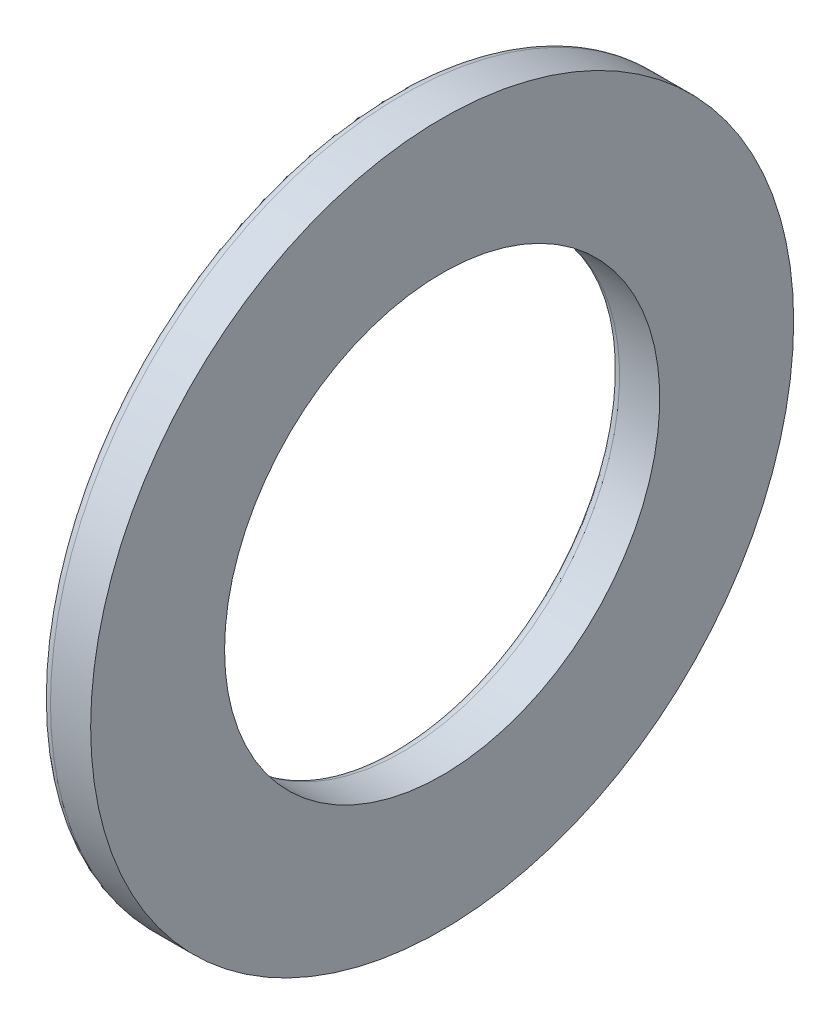
ISO-10303-21;
HEADER;
FILE_DESCRIPTION(('STEP AP214'),'2;1');
FILE_NAME('part.step','',(''),(''),'','','');
FILE_SCHEMA(('AUTOMOTIVE_DESIGN { 1 0 10303 214 1 1 1 1 }'));
ENDSEC;
DATA;
#1=APPLICATION_CONTEXT('core data for automotive mechanical design processes');
#2=APPLICATION_PROTOCOL_DEFINITION('international standard','automotive_design',2000,#1);
#3=PRODUCT_CONTEXT('',#1,'mechanical');
#4=PRODUCT('Part','Part','',(#3));
#5=PRODUCT_RELATED_PRODUCT_CATEGORY('part','',(#4));
#6=PRODUCT_DEFINITION_FORMATION('','',#4);
#7=PRODUCT_DEFINITION_CONTEXT('part definition',#1,'design');
#8=PRODUCT_DEFINITION('design','',#6,#7);
#9=PRODUCT_DEFINITION_SHAPE('','',#8);
#10=(LENGTH_UNIT() NAMED_UNIT(*) SI_UNIT(.MILLI.,.METRE.));
#11=(NAMED_UNIT(*) PLANE_ANGLE_UNIT() SI_UNIT($,.RADIAN.));
#12=(NAMED_UNIT(*) SI_UNIT($,.STERADIAN.) SOLID_ANGLE_UNIT());
#13=UNCERTAINTY_MEASURE_WITH_UNIT(LENGTH_MEASURE(1.E-05),#10,'distance_accuracy_value','');
#14=(GEOMETRIC_REPRESENTATION_CONTEXT(3) GLOBAL_UNCERTAINTY_ASSIGNED_CONTEXT((#13)) GLOBAL_UNIT_ASSIGNED_CONTEXT((#10,
#11,#12)) REPRESENTATION_CONTEXT('',''));
#15=CARTESIAN_POINT('',(0.,0.,0.));
#16=DIRECTION('',(0.,0.,1.));
#17=DIRECTION('',(1.,0.,0.));
#18=AXIS2_PLACEMENT_3D('',#15,#16,#17);
#19=CARTESIAN_POINT('',(3.,13.,0.));
#20=DIRECTION('',(-1.,0.,0.));
#21=DIRECTION('',(0.,0.,1.));
#22=AXIS2_PLACEMENT_3D('',#19,#20,#21);
#23=PLANE('',#22);
#24=CARTESIAN_POINT('',(3.,0.,0.));
#25=DIRECTION('',(-1.,0.,0.));
#26=DIRECTION('',(0.,0.,1.));
#27=AXIS2_PLACEMENT_3D('',#24,#25,#26);
#28=CIRCLE('',#27,21.);
#29=CARTESIAN_POINT('',(3.,0.,21.));
#30=VERTEX_POINT('',#29);
#31=EDGE_CURVE('E10',#30,#30,#28,.T.);
#32=ORIENTED_EDGE('',*,*,#31,.F.);
#33=EDGE_LOOP('',(#32));
#34=FACE_BOUND('',#33,.T.);
#35=CARTESIAN_POINT('',(3.,0.,0.));
#36=DIRECTION('',(-1.,0.,0.));
#37=DIRECTION('',(0.,0.,1.));
#38=AXIS2_PLACEMENT_3D('',#35,#36,#37);
#39=CIRCLE('',#38,13.);
#40=CARTESIAN_POINT('',(3.,0.,13.));
#41=VERTEX_POINT('',#40);
#42=EDGE_CURVE('E49',#41,#41,#39,.T.);
#43=ORIENTED_EDGE('',*,*,#42,.T.);
#44=EDGE_LOOP('',(#43));
#45=FACE_BOUND('',#44,.T.);
#46=ADVANCED_FACE('F15',(#34,#45),#23,.F.);
#47=CARTESIAN_POINT('',(3.,0.,0.));
#48=DIRECTION('',(-1.,0.,0.));
#49=DIRECTION('',(0.,0.,1.));
#50=AXIS2_PLACEMENT_3D('',#47,#48,#49);
#51=CYLINDRICAL_SURFACE('',#50,21.);
#52=CARTESIAN_POINT('',(0.6,0.,0.));
#53=DIRECTION('',(-1.,0.,0.));
#54=DIRECTION('',(0.,0.,1.));
#55=AXIS2_PLACEMENT_3D('',#52,#53,#54);
#56=CIRCLE('',#55,21.);
#57=CARTESIAN_POINT('',(0.6,0.,21.));
#58=VERTEX_POINT('',#57);
#59=EDGE_CURVE('E22',#58,#58,#56,.T.);
#60=ORIENTED_EDGE('',*,*,#59,.F.);
#61=EDGE_LOOP('',(#60));
#62=FACE_BOUND('',#61,.T.);
#63=ORIENTED_EDGE('',*,*,#31,.T.);
#64=EDGE_LOOP('',(#63));
#65=FACE_BOUND('',#64,.T.);
#66=ADVANCED_FACE('F75',(#62,#65),#51,.T.);
#67=CARTESIAN_POINT('',(0.6,0.,0.));
#68=DIRECTION('',(-1.,0.,0.));
#69=DIRECTION('',(0.,0.,1.));
#70=AXIS2_PLACEMENT_3D('',#67,#68,#69);
#71=TOROIDAL_SURFACE('',#70,20.4,0.6);
#72=CARTESIAN_POINT('',(0.,0.,0.));
#73=DIRECTION('',(-1.,0.,0.));
#74=DIRECTION('',(0.,0.,1.));
#75=AXIS2_PLACEMENT_3D('',#72,#73,#74);
#76=CIRCLE('',#75,20.4);
#77=CARTESIAN_POINT('',(0.,0.,20.4));
#78=VERTEX_POINT('',#77);
#79=EDGE_CURVE('E31',#78,#78,#76,.T.);
#80=ORIENTED_EDGE('',*,*,#79,.F.);
#81=EDGE_LOOP('',(#80));
#82=FACE_BOUND('',#81,.T.);
#83=ORIENTED_EDGE('',*,*,#59,.T.);
#84=EDGE_LOOP('',(#83));
#85=FACE_BOUND('',#84,.T.);
#86=ADVANCED_FACE('F70',(#82,#85),#71,.T.);
#87=CARTESIAN_POINT('',(0.,20.4,0.));
#88=DIRECTION('',(1.,0.,0.));
#89=DIRECTION('',(0.,0.,-1.));
#90=AXIS2_PLACEMENT_3D('',#87,#88,#89);
#91=PLANE('',#90);
#92=CARTESIAN_POINT('',(0.,0.,0.));
#93=DIRECTION('',(-1.,0.,0.));
#94=DIRECTION('',(0.,0.,1.));
#95=AXIS2_PLACEMENT_3D('',#92,#93,#94);
#96=CIRCLE('',#95,13.6);
#97=CARTESIAN_POINT('',(0.,0.,13.6));
#98=VERTEX_POINT('',#97);
#99=EDGE_CURVE('E39',#98,#98,#96,.T.);
#100=ORIENTED_EDGE('',*,*,#99,.F.);
#101=EDGE_LOOP('',(#100));
#102=FACE_BOUND('',#101,.T.);
#103=ORIENTED_EDGE('',*,*,#79,.T.);
#104=EDGE_LOOP('',(#103));
#105=FACE_BOUND('',#104,.T.);
#106=ADVANCED_FACE('F64',(#102,#105),#91,.F.);
#107=CARTESIAN_POINT('',(0.6,0.,0.));
#108=DIRECTION('',(-1.,0.,0.));
#109=DIRECTION('',(0.,0.,1.));
#110=AXIS2_PLACEMENT_3D('',#107,#108,#109);
#111=TOROIDAL_SURFACE('',#110,13.6,0.6);
#112=CARTESIAN_POINT('',(0.6,0.,0.));
#113=DIRECTION('',(-1.,0.,0.));
#114=DIRECTION('',(0.,0.,1.));
#115=AXIS2_PLACEMENT_3D('',#112,#113,#114);
#116=CIRCLE('',#115,13.);
#117=CARTESIAN_POINT('',(0.6,0.,13.));
#118=VERTEX_POINT('',#117);
#119=EDGE_CURVE('E45',#118,#118,#116,.T.);
#120=ORIENTED_EDGE('',*,*,#119,.F.);
#121=EDGE_LOOP('',(#120));
#122=FACE_BOUND('',#121,.T.);
#123=ORIENTED_EDGE('',*,*,#99,.T.);
#124=EDGE_LOOP('',(#123));
#125=FACE_BOUND('',#124,.T.);
#126=ADVANCED_FACE('F58',(#122,#125),#111,.T.);
#127=CARTESIAN_POINT('',(3.,0.,0.));
#128=DIRECTION('',(-1.,0.,0.));
#129=DIRECTION('',(0.,0.,1.));
#130=AXIS2_PLACEMENT_3D('',#127,#128,#129);
#131=CYLINDRICAL_SURFACE('',#130,13.);
#132=ORIENTED_EDGE('',*,*,#42,.F.);
#133=EDGE_LOOP('',(#132));
#134=FACE_BOUND('',#133,.T.);
#135=ORIENTED_EDGE('',*,*,#119,.T.);
#136=EDGE_LOOP('',(#135));
#137=FACE_BOUND('',#136,.T.);
#138=ADVANCED_FACE('F55',(#134,#137),#131,.F.);
#139=CLOSED_SHELL('',(#46,#66,#86,#106,#126,#138));
#140=MANIFOLD_SOLID_BREP('B1',#139);
#141=ADVANCED_BREP_SHAPE_REPRESENTATION('',(#18,#140),#14);
#142=SHAPE_DEFINITION_REPRESENTATION(#9,#141);
ENDSEC;
END-ISO-10303-21;
